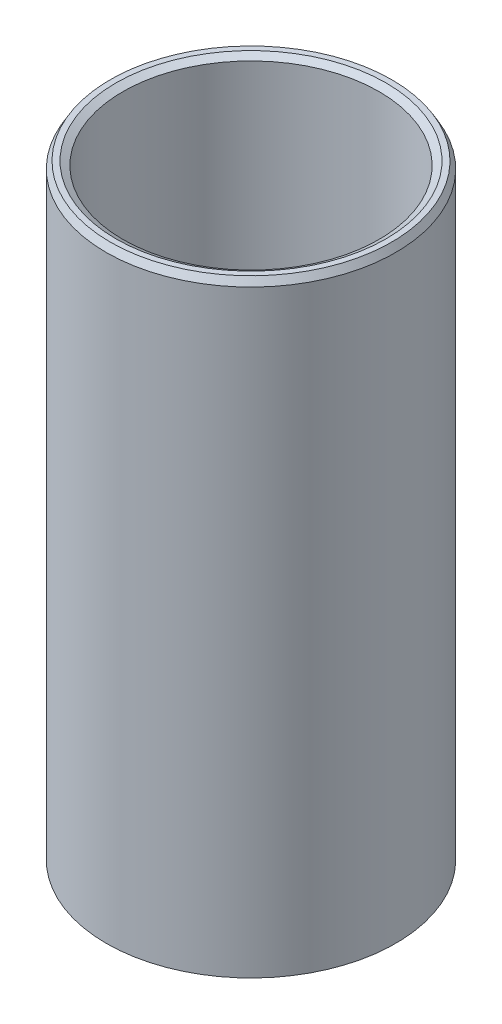
ISO-10303-21;
HEADER;
FILE_DESCRIPTION(('STEP AP214'),'2;1');
FILE_NAME('part.step','',(''),(''),'','','');
FILE_SCHEMA(('AUTOMOTIVE_DESIGN { 1 0 10303 214 1 1 1 1 }'));
ENDSEC;
DATA;
#1=APPLICATION_CONTEXT('core data for automotive mechanical design processes');
#2=APPLICATION_PROTOCOL_DEFINITION('international standard','automotive_design',2000,#1);
#3=PRODUCT_CONTEXT('',#1,'mechanical');
#4=PRODUCT('Part','Part','',(#3));
#5=PRODUCT_RELATED_PRODUCT_CATEGORY('part','',(#4));
#6=PRODUCT_DEFINITION_FORMATION('','',#4);
#7=PRODUCT_DEFINITION_CONTEXT('part definition',#1,'design');
#8=PRODUCT_DEFINITION('design','',#6,#7);
#9=PRODUCT_DEFINITION_SHAPE('','',#8);
#10=(LENGTH_UNIT() NAMED_UNIT(*) SI_UNIT(.MILLI.,.METRE.));
#11=(NAMED_UNIT(*) PLANE_ANGLE_UNIT() SI_UNIT($,.RADIAN.));
#12=(NAMED_UNIT(*) SI_UNIT($,.STERADIAN.) SOLID_ANGLE_UNIT());
#13=UNCERTAINTY_MEASURE_WITH_UNIT(LENGTH_MEASURE(1.E-05),#10,'distance_accuracy_value','');
#14=(GEOMETRIC_REPRESENTATION_CONTEXT(3) GLOBAL_UNCERTAINTY_ASSIGNED_CONTEXT((#13)) GLOBAL_UNIT_ASSIGNED_CONTEXT((#10,
#11,#12)) REPRESENTATION_CONTEXT('',''));
#15=CARTESIAN_POINT('',(0.,0.,0.));
#16=DIRECTION('',(0.,0.,1.));
#17=DIRECTION('',(1.,0.,0.));
#18=AXIS2_PLACEMENT_3D('',#15,#16,#17);
#19=CARTESIAN_POINT('',(0.,157.859497230214,0.));
#20=DIRECTION('',(0.,-1.,0.));
#21=DIRECTION('',(0.,0.,-1.));
#22=AXIS2_PLACEMENT_3D('',#19,#20,#21);
#23=CYLINDRICAL_SURFACE('',#22,37.5);
#24=CARTESIAN_POINT('',(0.,1.0414884097632,0.));
#25=DIRECTION('',(0.,1.,0.));
#26=DIRECTION('',(0.,0.,1.));
#27=AXIS2_PLACEMENT_3D('',#24,#25,#26);
#28=CIRCLE('',#27,37.5);
#29=CARTESIAN_POINT('',(0.,1.04148840976317,-37.5));
#30=VERTEX_POINT('',#29);
#31=EDGE_CURVE('E10',#30,#30,#28,.T.);
#32=CARTESIAN_POINT('',(0.,156.05558638901,0.));
#33=DIRECTION('',(0.,1.,0.));
#34=DIRECTION('',(0.,0.,1.));
#35=AXIS2_PLACEMENT_3D('',#32,#33,#34);
#36=CIRCLE('',#35,37.5);
#37=CARTESIAN_POINT('',(0.,156.05558638901,-37.5));
#38=VERTEX_POINT('',#37);
#39=EDGE_CURVE('E50',#38,#38,#36,.F.);
#40=CARTESIAN_POINT('',(0.,1.04148840976317,-37.5));
#41=CARTESIAN_POINT('',(0.,2.656218597047,-37.5));
#42=CARTESIAN_POINT('',(0.,4.27094878433083,-37.5));
#43=CARTESIAN_POINT('',(0.,7.50040915889848,-37.5));
#44=CARTESIAN_POINT('',(0.,9.11513934618231,-37.5));
#45=CARTESIAN_POINT('',(0.,12.34459972075,-37.5));
#46=CARTESIAN_POINT('',(0.,13.9593299080338,-37.5));
#47=CARTESIAN_POINT('',(0.,17.1887902826014,-37.5));
#48=CARTESIAN_POINT('',(0.,18.8035204698852,-37.5));
#49=CARTESIAN_POINT('',(0.,22.0329808444529,-37.5));
#50=CARTESIAN_POINT('',(0.,23.6477110317367,-37.5));
#51=CARTESIAN_POINT('',(0.,26.8771714063044,-37.5));
#52=CARTESIAN_POINT('',(0.,28.4919015935882,-37.5));
#53=CARTESIAN_POINT('',(0.,31.7213619681559,-37.5));
#54=CARTESIAN_POINT('',(0.,33.3360921554397,-37.5));
#55=CARTESIAN_POINT('',(0.,36.5655525300073,-37.5));
#56=CARTESIAN_POINT('',(0.,38.1802827172911,-37.5));
#57=CARTESIAN_POINT('',(0.,41.4097430918588,-37.5));
#58=CARTESIAN_POINT('',(0.,43.0244732791426,-37.5));
#59=CARTESIAN_POINT('',(0.,46.2539336537103,-37.5));
#60=CARTESIAN_POINT('',(0.,47.8686638409941,-37.5));
#61=CARTESIAN_POINT('',(0.,51.0981242155617,-37.5));
#62=CARTESIAN_POINT('',(0.,52.7128544028456,-37.5));
#63=CARTESIAN_POINT('',(0.,55.9423147774132,-37.5));
#64=CARTESIAN_POINT('',(0.,57.557044964697,-37.5));
#65=CARTESIAN_POINT('',(0.,60.7865053392647,-37.5));
#66=CARTESIAN_POINT('',(0.,62.4012355265485,-37.5));
#67=CARTESIAN_POINT('',(0.,65.6306959011162,-37.5));
#68=CARTESIAN_POINT('',(0.,67.2454260884,-37.5));
#69=CARTESIAN_POINT('',(0.,70.4748864629676,-37.5));
#70=CARTESIAN_POINT('',(0.,72.0896166502515,-37.5));
#71=CARTESIAN_POINT('',(0.,75.3190770248191,-37.5));
#72=CARTESIAN_POINT('',(0.,76.9338072121029,-37.5));
#73=CARTESIAN_POINT('',(0.,80.1632675866706,-37.5));
#74=CARTESIAN_POINT('',(0.,81.7779977739544,-37.5));
#75=CARTESIAN_POINT('',(0.,85.0074581485221,-37.5));
#76=CARTESIAN_POINT('',(0.,86.6221883358059,-37.5));
#77=CARTESIAN_POINT('',(0.,89.8516487103735,-37.5));
#78=CARTESIAN_POINT('',(0.,91.4663788976574,-37.5));
#79=CARTESIAN_POINT('',(0.,94.695839272225,-37.5));
#80=CARTESIAN_POINT('',(0.,96.3105694595088,-37.5));
#81=CARTESIAN_POINT('',(0.,99.5400298340765,-37.5));
#82=CARTESIAN_POINT('',(0.,101.15476002136,-37.5));
#83=CARTESIAN_POINT('',(0.,104.384220395928,-37.5));
#84=CARTESIAN_POINT('',(0.,105.998950583212,-37.5));
#85=CARTESIAN_POINT('',(0.,109.228410957779,-37.5));
#86=CARTESIAN_POINT('',(0.,110.843141145063,-37.5));
#87=CARTESIAN_POINT('',(0.,114.072601519631,-37.5));
#88=CARTESIAN_POINT('',(0.,115.687331706915,-37.5));
#89=CARTESIAN_POINT('',(0.,118.916792081482,-37.5));
#90=CARTESIAN_POINT('',(0.,120.531522268766,-37.5));
#91=CARTESIAN_POINT('',(0.,123.760982643334,-37.5));
#92=CARTESIAN_POINT('',(0.,125.375712830618,-37.5));
#93=CARTESIAN_POINT('',(0.,128.605173205185,-37.5));
#94=CARTESIAN_POINT('',(0.,130.219903392469,-37.5));
#95=CARTESIAN_POINT('',(0.,133.449363767037,-37.5));
#96=CARTESIAN_POINT('',(0.,135.064093954321,-37.5));
#97=CARTESIAN_POINT('',(0.,138.293554328888,-37.5));
#98=CARTESIAN_POINT('',(0.,139.908284516172,-37.5));
#99=CARTESIAN_POINT('',(0.,143.13774489074,-37.5));
#100=CARTESIAN_POINT('',(0.,144.752475078024,-37.5));
#101=CARTESIAN_POINT('',(0.,147.981935452591,-37.5));
#102=CARTESIAN_POINT('',(0.,149.596665639875,-37.5));
#103=CARTESIAN_POINT('',(0.,152.826126014443,-37.5));
#104=CARTESIAN_POINT('',(0.,154.440856201727,-37.5));
#105=CARTESIAN_POINT('',(0.,156.05558638901,-37.5));
#106=B_SPLINE_CURVE_WITH_KNOTS('',3,(#40,#41,#42,#43,#44,#45,#46,#47,#48,#49,#50,#51,#52,#53,
#54,#55,#56,#57,#58,#59,#60,#61,#62,#63,#64,#65,#66,#67,#68,#69,#70,#71,#72,#73,#74,#75,#76,#77,
#78,#79,#80,#81,#82,#83,#84,#85,#86,#87,#88,#89,#90,#91,#92,#93,#94,#95,#96,#97,#98,#99,#100,
#101,#102,#103,#104,#105),.UNSPECIFIED.,.F.,.F.,(4,2,2,2,2,2,2,2,2,2,2,2,2,2,2,2,2,2,2,2,2,2,2,
2,2,2,2,2,2,2,2,2,4),(0.,4.84419056185148,9.68838112370296,14.5325716855544,19.3767622474059,
24.2209528092574,29.0651433711089,33.9093339329603,38.7535244948118,43.5977150566633,
48.4419056185147,53.2860961803662,58.1302867422177,62.9744773040692,67.8186678659207,
72.6628584277721,77.5070489896236,82.3512395514751,87.1954301133266,92.039620675178,
96.8838112370295,101.728001798881,106.572192360732,111.416382922584,116.260573484435,
121.104764046287,125.948954608138,130.79314516999,135.637335731841,140.481526293693,
145.325716855544,150.169907417396,155.014097979247),.UNSPECIFIED.);
#107=EDGE_CURVE('BSEAM39',#30,#38,#106,.T.);
#108=ORIENTED_EDGE('',*,*,#31,.T.);
#109=ORIENTED_EDGE('',*,*,#39,.T.);
#110=ORIENTED_EDGE('',*,*,#107,.T.);
#111=ORIENTED_EDGE('',*,*,#107,.F.);
#112=EDGE_LOOP('',(#108,#110,#109,#111));
#113=FACE_BOUND('',#112,.T.);
#114=ADVANCED_FACE('F39',(#113),#23,.T.);
#115=CARTESIAN_POINT('',(0.,157.859497230214,0.));
#116=DIRECTION('',(0.,1.,0.));
#117=DIRECTION('',(0.,0.,1.));
#118=AXIS2_PLACEMENT_3D('',#115,#116,#117);
#119=PLANE('',#118);
#120=CARTESIAN_POINT('',(0.,157.859497230214,0.));
#121=DIRECTION('',(0.,1.,0.));
#122=DIRECTION('',(0.,0.,1.));
#123=AXIS2_PLACEMENT_3D('',#120,#121,#122);
#124=CIRCLE('',#123,34.9908820665083);
#125=CARTESIAN_POINT('',(0.,157.859497230214,34.9908820665083));
#126=VERTEX_POINT('',#125);
#127=EDGE_CURVE('E58',#126,#126,#124,.F.);
#128=ORIENTED_EDGE('',*,*,#127,.T.);
#129=EDGE_LOOP('',(#128));
#130=FACE_BOUND('',#129,.T.);
#131=CARTESIAN_POINT('',(0.,157.859497230214,0.));
#132=DIRECTION('',(0.,1.,0.));
#133=DIRECTION('',(0.,0.,1.));
#134=AXIS2_PLACEMENT_3D('',#131,#132,#133);
#135=CIRCLE('',#134,36.458511590237);
#136=CARTESIAN_POINT('',(0.,157.859497230214,36.458511590237));
#137=VERTEX_POINT('',#136);
#138=EDGE_CURVE('E61',#137,#137,#135,.T.);
#139=ORIENTED_EDGE('',*,*,#138,.T.);
#140=EDGE_LOOP('',(#139));
#141=FACE_BOUND('',#140,.T.);
#142=ADVANCED_FACE('F88',(#130,#141),#119,.T.);
#143=CARTESIAN_POINT('',(0.,0.,0.));
#144=DIRECTION('',(0.,1.,0.));
#145=DIRECTION('',(0.,0.,1.));
#146=AXIS2_PLACEMENT_3D('',#143,#144,#145);
#147=PLANE('',#146);
#148=CARTESIAN_POINT('',(0.,0.,0.));
#149=DIRECTION('',(0.,1.,0.));
#150=DIRECTION('',(0.,0.,1.));
#151=AXIS2_PLACEMENT_3D('',#148,#149,#150);
#152=CIRCLE('',#151,34.2284596350674);
#153=CARTESIAN_POINT('',(0.,0.,34.2284596350674));
#154=VERTEX_POINT('',#153);
#155=EDGE_CURVE('E51',#154,#154,#152,.T.);
#156=ORIENTED_EDGE('',*,*,#155,.T.);
#157=EDGE_LOOP('',(#156));
#158=FACE_BOUND('',#157,.T.);
#159=CARTESIAN_POINT('',(0.,0.,0.));
#160=DIRECTION('',(0.,1.,0.));
#161=DIRECTION('',(0.,0.,1.));
#162=AXIS2_PLACEMENT_3D('',#159,#160,#161);
#163=CIRCLE('',#162,35.696089158796);
#164=CARTESIAN_POINT('',(0.,0.,35.696089158796));
#165=VERTEX_POINT('',#164);
#166=EDGE_CURVE('E54',#165,#165,#163,.F.);
#167=ORIENTED_EDGE('',*,*,#166,.T.);
#168=EDGE_LOOP('',(#167));
#169=FACE_BOUND('',#168,.T.);
#170=ADVANCED_FACE('F83',(#158,#169),#147,.F.);
#171=CARTESIAN_POINT('',(0.,157.859497230214,0.));
#172=DIRECTION('',(0.,-1.,0.));
#173=DIRECTION('',(0.,0.,-1.));
#174=AXIS2_PLACEMENT_3D('',#171,#172,#173);
#175=CYLINDRICAL_SURFACE('',#174,33.1869712253043);
#176=CARTESIAN_POINT('',(0.,156.818008820451,0.));
#177=DIRECTION('',(0.,1.,0.));
#178=DIRECTION('',(0.,0.,1.));
#179=AXIS2_PLACEMENT_3D('',#176,#177,#178);
#180=CIRCLE('',#179,33.1869712253043);
#181=CARTESIAN_POINT('',(0.,156.818008820451,-33.1869712253043));
#182=VERTEX_POINT('',#181);
#183=EDGE_CURVE('E67',#182,#182,#180,.T.);
#184=CARTESIAN_POINT('',(0.,1.80391084120388,0.));
#185=DIRECTION('',(0.,1.,0.));
#186=DIRECTION('',(0.,0.,1.));
#187=AXIS2_PLACEMENT_3D('',#184,#185,#186);
#188=CIRCLE('',#187,33.1869712253043);
#189=CARTESIAN_POINT('',(0.,1.80391084120388,-33.1869712253043));
#190=VERTEX_POINT('',#189);
#191=EDGE_CURVE('E69',#190,#190,#188,.F.);
#192=CARTESIAN_POINT('',(0.,156.818008820451,-33.1869712253043));
#193=CARTESIAN_POINT('',(0.,155.203278633167,-33.1869712253043));
#194=CARTESIAN_POINT('',(0.,153.588548445883,-33.1869712253043));
#195=CARTESIAN_POINT('',(0.,150.359088071316,-33.1869712253043));
#196=CARTESIAN_POINT('',(0.,148.744357884032,-33.1869712253043));
#197=CARTESIAN_POINT('',(0.,145.514897509464,-33.1869712253043));
#198=CARTESIAN_POINT('',(0.,143.90016732218,-33.1869712253043));
#199=CARTESIAN_POINT('',(0.,140.670706947613,-33.1869712253043));
#200=CARTESIAN_POINT('',(0.,139.055976760329,-33.1869712253043));
#201=CARTESIAN_POINT('',(0.,135.826516385761,-33.1869712253043));
#202=CARTESIAN_POINT('',(0.,134.211786198477,-33.1869712253043));
#203=CARTESIAN_POINT('',(0.,130.98232582391,-33.1869712253043));
#204=CARTESIAN_POINT('',(0.,129.367595636626,-33.1869712253043));
#205=CARTESIAN_POINT('',(0.,126.138135262058,-33.1869712253043));
#206=CARTESIAN_POINT('',(0.,124.523405074775,-33.1869712253043));
#207=CARTESIAN_POINT('',(0.,121.293944700207,-33.1869712253043));
#208=CARTESIAN_POINT('',(0.,119.679214512923,-33.1869712253043));
#209=CARTESIAN_POINT('',(0.,116.449754138355,-33.1869712253043));
#210=CARTESIAN_POINT('',(0.,114.835023951072,-33.1869712253043));
#211=CARTESIAN_POINT('',(0.,111.605563576504,-33.1869712253043));
#212=CARTESIAN_POINT('',(0.,109.99083338922,-33.1869712253043));
#213=CARTESIAN_POINT('',(0.,106.761373014652,-33.1869712253043));
#214=CARTESIAN_POINT('',(0.,105.146642827369,-33.1869712253043));
#215=CARTESIAN_POINT('',(0.,101.917182452801,-33.1869712253043));
#216=CARTESIAN_POINT('',(0.,100.302452265517,-33.1869712253043));
#217=CARTESIAN_POINT('',(0.,97.0729918909495,-33.1869712253043));
#218=CARTESIAN_POINT('',(0.,95.4582617036657,-33.1869712253043));
#219=CARTESIAN_POINT('',(0.,92.228801329098,-33.1869712253043));
#220=CARTESIAN_POINT('',(0.,90.6140711418142,-33.1869712253043));
#221=CARTESIAN_POINT('',(0.,87.3846107672466,-33.1869712253043));
#222=CARTESIAN_POINT('',(0.,85.7698805799627,-33.1869712253043));
#223=CARTESIAN_POINT('',(0.,82.5404202053951,-33.1869712253043));
#224=CARTESIAN_POINT('',(0.,80.9256900181113,-33.1869712253043));
#225=CARTESIAN_POINT('',(0.,77.6962296435436,-33.1869712253043));
#226=CARTESIAN_POINT('',(0.,76.0814994562598,-33.1869712253043));
#227=CARTESIAN_POINT('',(0.,72.8520390816921,-33.1869712253043));
#228=CARTESIAN_POINT('',(0.,71.2373088944083,-33.1869712253043));
#229=CARTESIAN_POINT('',(0.,68.0078485198407,-33.1869712253043));
#230=CARTESIAN_POINT('',(0.,66.3931183325568,-33.1869712253043));
#231=CARTESIAN_POINT('',(0.,63.1636579579892,-33.1869712253043));
#232=CARTESIAN_POINT('',(0.,61.5489277707054,-33.1869712253043));
#233=CARTESIAN_POINT('',(0.,58.3194673961377,-33.1869712253043));
#234=CARTESIAN_POINT('',(0.,56.7047372088539,-33.1869712253043));
#235=CARTESIAN_POINT('',(0.,53.4752768342862,-33.1869712253043));
#236=CARTESIAN_POINT('',(0.,51.8605466470024,-33.1869712253043));
#237=CARTESIAN_POINT('',(0.,48.6310862724348,-33.1869712253043));
#238=CARTESIAN_POINT('',(0.,47.016356085151,-33.1869712253043));
#239=CARTESIAN_POINT('',(0.,43.7868957105833,-33.1869712253043));
#240=CARTESIAN_POINT('',(0.,42.1721655232995,-33.1869712253043));
#241=CARTESIAN_POINT('',(0.,38.9427051487318,-33.1869712253043));
#242=CARTESIAN_POINT('',(0.,37.327974961448,-33.1869712253043));
#243=CARTESIAN_POINT('',(0.,34.0985145868804,-33.1869712253043));
#244=CARTESIAN_POINT('',(0.,32.4837843995965,-33.1869712253043));
#245=CARTESIAN_POINT('',(0.,29.2543240250289,-33.1869712253043));
#246=CARTESIAN_POINT('',(0.,27.6395938377451,-33.1869712253043));
#247=CARTESIAN_POINT('',(0.,24.4101334631774,-33.1869712253043));
#248=CARTESIAN_POINT('',(0.,22.7954032758936,-33.1869712253043));
#249=CARTESIAN_POINT('',(0.,19.5659429013259,-33.1869712253043));
#250=CARTESIAN_POINT('',(0.,17.9512127140421,-33.1869712253043));
#251=CARTESIAN_POINT('',(0.,14.7217523394745,-33.1869712253043));
#252=CARTESIAN_POINT('',(0.,13.1070221521906,-33.1869712253043));
#253=CARTESIAN_POINT('',(0.,9.87756177762299,-33.1869712253043));
#254=CARTESIAN_POINT('',(0.,8.26283159033917,-33.1869712253043));
#255=CARTESIAN_POINT('',(0.,5.03337121577153,-33.1869712253043));
#256=CARTESIAN_POINT('',(0.,3.4186410284877,-33.1869712253043));
#257=CARTESIAN_POINT('',(0.,1.80391084120388,-33.1869712253043));
#258=B_SPLINE_CURVE_WITH_KNOTS('',3,(#192,#193,#194,#195,#196,#197,#198,#199,#200,#201,#202,
#203,#204,#205,#206,#207,#208,#209,#210,#211,#212,#213,#214,#215,#216,#217,#218,#219,#220,#221,
#222,#223,#224,#225,#226,#227,#228,#229,#230,#231,#232,#233,#234,#235,#236,#237,#238,#239,#240,
#241,#242,#243,#244,#245,#246,#247,#248,#249,#250,#251,#252,#253,#254,#255,#256,#257),
.UNSPECIFIED.,.F.,.F.,(4,2,2,2,2,2,2,2,2,2,2,2,2,2,2,2,2,2,2,2,2,2,2,2,2,2,2,2,2,2,2,2,4),(0.,
4.84419056185145,9.68838112370293,14.5325716855544,19.3767622474059,24.2209528092573,
29.0651433711088,33.9093339329603,38.7535244948118,43.5977150566632,48.4419056185147,
53.2860961803662,58.1302867422176,62.9744773040691,67.8186678659206,72.6628584277721,
77.5070489896235,82.351239551475,87.1954301133265,92.0396206751779,96.8838112370294,
101.728001798881,106.572192360732,111.416382922584,116.260573484435,121.104764046287,
125.948954608138,130.79314516999,135.637335731841,140.481526293693,145.325716855544,
150.169907417396,155.014097979247),.UNSPECIFIED.);
#259=EDGE_CURVE('BSEAM71',#182,#190,#258,.T.);
#260=ORIENTED_EDGE('',*,*,#183,.T.);
#261=ORIENTED_EDGE('',*,*,#191,.T.);
#262=ORIENTED_EDGE('',*,*,#259,.T.);
#263=ORIENTED_EDGE('',*,*,#259,.F.);
#264=EDGE_LOOP('',(#260,#262,#261,#263));
#265=FACE_BOUND('',#264,.T.);
#266=ADVANCED_FACE('F71',(#265),#175,.F.);
#267=CARTESIAN_POINT('',(0.,156.818008820451,0.));
#268=DIRECTION('',(0.,1.,0.));
#269=DIRECTION('',(0.,0.,1.));
#270=AXIS2_PLACEMENT_3D('',#267,#268,#269);
#271=CONICAL_SURFACE('',#270,33.1869712253043,1.04719755119661);
#272=ORIENTED_EDGE('',*,*,#127,.F.);
#273=EDGE_LOOP('',(#272));
#274=FACE_BOUND('',#273,.T.);
#275=ORIENTED_EDGE('',*,*,#183,.F.);
#276=EDGE_LOOP('',(#275));
#277=FACE_BOUND('',#276,.T.);
#278=ADVANCED_FACE('F77',(#274,#277),#271,.F.);
#279=CARTESIAN_POINT('',(0.,0.,0.));
#280=DIRECTION('',(0.,-1.,0.));
#281=DIRECTION('',(0.,0.,-1.));
#282=AXIS2_PLACEMENT_3D('',#279,#280,#281);
#283=CONICAL_SURFACE('',#282,34.2284596350674,0.523598775598298);
#284=ORIENTED_EDGE('',*,*,#191,.F.);
#285=EDGE_LOOP('',(#284));
#286=FACE_BOUND('',#285,.T.);
#287=ORIENTED_EDGE('',*,*,#155,.F.);
#288=EDGE_LOOP('',(#287));
#289=FACE_BOUND('',#288,.T.);
#290=ADVANCED_FACE('F73',(#286,#289),#283,.F.);
#291=CARTESIAN_POINT('',(0.,1.0414884097632,0.));
#292=DIRECTION('',(0.,1.,0.));
#293=DIRECTION('',(0.,0.,1.));
#294=AXIS2_PLACEMENT_3D('',#291,#292,#293);
#295=CONICAL_SURFACE('',#294,37.5,1.0471975511966);
#296=ORIENTED_EDGE('',*,*,#166,.F.);
#297=EDGE_LOOP('',(#296));
#298=FACE_BOUND('',#297,.T.);
#299=ORIENTED_EDGE('',*,*,#31,.F.);
#300=EDGE_LOOP('',(#299));
#301=FACE_BOUND('',#300,.T.);
#302=ADVANCED_FACE('F76',(#298,#301),#295,.T.);
#303=CARTESIAN_POINT('',(0.,157.859497230214,0.));
#304=DIRECTION('',(0.,-1.,0.));
#305=DIRECTION('',(0.,0.,-1.));
#306=AXIS2_PLACEMENT_3D('',#303,#304,#305);
#307=CONICAL_SURFACE('',#306,36.458511590237,0.52359877559828);
#308=ORIENTED_EDGE('',*,*,#39,.F.);
#309=EDGE_LOOP('',(#308));
#310=FACE_BOUND('',#309,.T.);
#311=ORIENTED_EDGE('',*,*,#138,.F.);
#312=EDGE_LOOP('',(#311));
#313=FACE_BOUND('',#312,.T.);
#314=ADVANCED_FACE('F45',(#310,#313),#307,.T.);
#315=CLOSED_SHELL('',(#114,#142,#170,#266,#278,#290,#302,#314));
#316=MANIFOLD_SOLID_BREP('B2',#315);
#317=ADVANCED_BREP_SHAPE_REPRESENTATION('',(#18,#316),#14);
#318=SHAPE_DEFINITION_REPRESENTATION(#9,#317);
ENDSEC;
END-ISO-10303-21;
